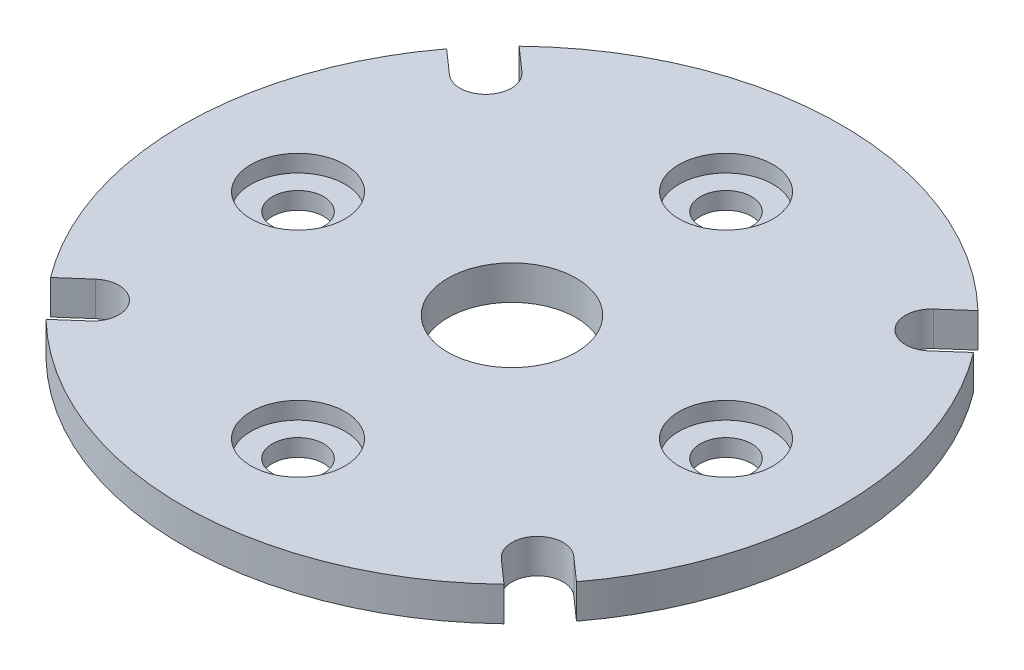
ISO-10303-21;
HEADER;
FILE_DESCRIPTION(('STEP AP214'),'2;1');
FILE_NAME('part.step','',(''),(''),'','','');
FILE_SCHEMA(('AUTOMOTIVE_DESIGN { 1 0 10303 214 1 1 1 1 }'));
ENDSEC;
DATA;
#1=APPLICATION_CONTEXT('core data for automotive mechanical design processes');
#2=APPLICATION_PROTOCOL_DEFINITION('international standard','automotive_design',2000,#1);
#3=PRODUCT_CONTEXT('',#1,'mechanical');
#4=PRODUCT('Part','Part','',(#3));
#5=PRODUCT_RELATED_PRODUCT_CATEGORY('part','',(#4));
#6=PRODUCT_DEFINITION_FORMATION('','',#4);
#7=PRODUCT_DEFINITION_CONTEXT('part definition',#1,'design');
#8=PRODUCT_DEFINITION('design','',#6,#7);
#9=PRODUCT_DEFINITION_SHAPE('','',#8);
#10=(LENGTH_UNIT() NAMED_UNIT(*) SI_UNIT(.MILLI.,.METRE.));
#11=(NAMED_UNIT(*) PLANE_ANGLE_UNIT() SI_UNIT($,.RADIAN.));
#12=(NAMED_UNIT(*) SI_UNIT($,.STERADIAN.) SOLID_ANGLE_UNIT());
#13=UNCERTAINTY_MEASURE_WITH_UNIT(LENGTH_MEASURE(1.E-05),#10,'distance_accuracy_value','');
#14=(GEOMETRIC_REPRESENTATION_CONTEXT(3) GLOBAL_UNCERTAINTY_ASSIGNED_CONTEXT((#13)) GLOBAL_UNIT_ASSIGNED_CONTEXT((#10,
#11,#12)) REPRESENTATION_CONTEXT('',''));
#15=CARTESIAN_POINT('',(0.,0.,0.));
#16=DIRECTION('',(0.,0.,1.));
#17=DIRECTION('',(1.,0.,0.));
#18=AXIS2_PLACEMENT_3D('',#15,#16,#17);
#19=CARTESIAN_POINT('',(-2196.04150385978,-137.284072907056,1150.50690940021));
#20=DIRECTION('',(0.,-1.,-1.36470032429931E-12));
#21=DIRECTION('',(1.,0.,0.));
#22=AXIS2_PLACEMENT_3D('',#19,#20,#21);
#23=PLANE('',#22);
#24=CARTESIAN_POINT('',(-2221.04150385978,-137.284072907056,1150.50690940021));
#25=DIRECTION('',(0.,-1.,-1.36470032429931E-12));
#26=DIRECTION('',(1.,0.,0.));
#27=AXIS2_PLACEMENT_3D('',#24,#25,#26);
#28=CIRCLE('',#27,3.00000000000011);
#29=CARTESIAN_POINT('',(-2218.04150385978,-137.284072907056,1150.50690940021));
#30=VERTEX_POINT('',#29);
#31=EDGE_CURVE('E213',#30,#30,#28,.T.);
#32=ORIENTED_EDGE('',*,*,#31,.T.);
#33=EDGE_LOOP('',(#32));
#34=FACE_BOUND('',#33,.T.);
#35=CARTESIAN_POINT('',(-2221.04150385978,-137.284072907056,1150.50690940021));
#36=DIRECTION('',(0.,-1.,-1.36470032429931E-12));
#37=DIRECTION('',(1.,0.,0.));
#38=AXIS2_PLACEMENT_3D('',#35,#36,#37);
#39=CIRCLE('',#38,5.50000000000006);
#40=CARTESIAN_POINT('',(-2215.54150385978,-137.284072907056,1150.50690940021));
#41=VERTEX_POINT('',#40);
#42=EDGE_CURVE('E170',#41,#41,#39,.T.);
#43=ORIENTED_EDGE('',*,*,#42,.F.);
#44=EDGE_LOOP('',(#43));
#45=FACE_BOUND('',#44,.T.);
#46=ADVANCED_FACE('F34',(#34,#45),#23,.F.);
#47=CARTESIAN_POINT('',(-2196.04150385978,-137.28407290709,1175.50690940021));
#48=DIRECTION('',(0.,-1.,-1.36470032429931E-12));
#49=DIRECTION('',(1.,0.,0.));
#50=AXIS2_PLACEMENT_3D('',#47,#48,#49);
#51=CIRCLE('',#50,3.00000000000011);
#52=CARTESIAN_POINT('',(-2193.04150385978,-137.28407290709,1175.50690940021));
#53=VERTEX_POINT('',#52);
#54=EDGE_CURVE('E229',#53,#53,#51,.T.);
#55=ORIENTED_EDGE('',*,*,#54,.T.);
#56=EDGE_LOOP('',(#55));
#57=FACE_BOUND('',#56,.T.);
#58=CARTESIAN_POINT('',(-2196.04150385978,-137.28407290709,1175.50690940021));
#59=DIRECTION('',(0.,-1.,-1.36470032429931E-12));
#60=DIRECTION('',(1.,0.,0.));
#61=AXIS2_PLACEMENT_3D('',#58,#59,#60);
#62=CIRCLE('',#61,5.50000000000006);
#63=CARTESIAN_POINT('',(-2190.54150385978,-137.28407290709,1175.50690940021));
#64=VERTEX_POINT('',#63);
#65=EDGE_CURVE('E409',#64,#64,#62,.T.);
#66=ORIENTED_EDGE('',*,*,#65,.F.);
#67=EDGE_LOOP('',(#66));
#68=FACE_BOUND('',#67,.T.);
#69=ADVANCED_FACE('F373',(#57,#68),#23,.F.);
#70=CARTESIAN_POINT('',(-2196.04150385978,-137.284072907022,1125.50690940021));
#71=DIRECTION('',(0.,-1.,-1.36470032429931E-12));
#72=DIRECTION('',(1.,0.,0.));
#73=AXIS2_PLACEMENT_3D('',#70,#71,#72);
#74=CIRCLE('',#73,3.00000000000011);
#75=CARTESIAN_POINT('',(-2193.04150385978,-137.284072907022,1125.50690940021));
#76=VERTEX_POINT('',#75);
#77=EDGE_CURVE('E217',#76,#76,#74,.T.);
#78=ORIENTED_EDGE('',*,*,#77,.T.);
#79=EDGE_LOOP('',(#78));
#80=FACE_BOUND('',#79,.T.);
#81=CARTESIAN_POINT('',(-2196.04150385978,-137.284072907022,1125.50690940021));
#82=DIRECTION('',(0.,-1.,-1.36470032429931E-12));
#83=DIRECTION('',(1.,0.,0.));
#84=AXIS2_PLACEMENT_3D('',#81,#82,#83);
#85=CIRCLE('',#84,5.50000000000006);
#86=CARTESIAN_POINT('',(-2190.54150385978,-137.284072907022,1125.50690940021));
#87=VERTEX_POINT('',#86);
#88=EDGE_CURVE('E401',#87,#87,#85,.T.);
#89=ORIENTED_EDGE('',*,*,#88,.F.);
#90=EDGE_LOOP('',(#89));
#91=FACE_BOUND('',#90,.T.);
#92=ADVANCED_FACE('F379',(#80,#91),#23,.F.);
#93=CARTESIAN_POINT('',(-2171.04150385978,-137.284072907056,1150.50690940021));
#94=DIRECTION('',(0.,-1.,-1.36470032429931E-12));
#95=DIRECTION('',(1.,0.,0.));
#96=AXIS2_PLACEMENT_3D('',#93,#94,#95);
#97=CIRCLE('',#96,3.00000000000011);
#98=CARTESIAN_POINT('',(-2168.04150385978,-137.284072907056,1150.50690940021));
#99=VERTEX_POINT('',#98);
#100=EDGE_CURVE('E223',#99,#99,#97,.T.);
#101=ORIENTED_EDGE('',*,*,#100,.T.);
#102=EDGE_LOOP('',(#101));
#103=FACE_BOUND('',#102,.T.);
#104=CARTESIAN_POINT('',(-2171.04150385978,-137.284072907056,1150.50690940021));
#105=DIRECTION('',(0.,-1.,-1.36470032429931E-12));
#106=DIRECTION('',(1.,0.,0.));
#107=AXIS2_PLACEMENT_3D('',#104,#105,#106);
#108=CIRCLE('',#107,5.50000000000006);
#109=CARTESIAN_POINT('',(-2165.54150385978,-137.284072907056,1150.50690940021));
#110=VERTEX_POINT('',#109);
#111=EDGE_CURVE('E395',#110,#110,#108,.T.);
#112=ORIENTED_EDGE('',*,*,#111,.F.);
#113=EDGE_LOOP('',(#112));
#114=FACE_BOUND('',#113,.T.);
#115=ADVANCED_FACE('F375',(#103,#114),#23,.F.);
#116=CARTESIAN_POINT('',(-2196.04150385978,-139.284072907056,1150.50690940021));
#117=DIRECTION('',(0.,-1.,-1.36470032429931E-12));
#118=DIRECTION('',(1.,0.,0.));
#119=AXIS2_PLACEMENT_3D('',#116,#117,#118);
#120=PLANE('',#119);
#121=CARTESIAN_POINT('',(-2196.04150385978,-139.284072907022,1125.50690940021));
#122=DIRECTION('',(0.,-1.,-1.36470032429931E-12));
#123=DIRECTION('',(1.,0.,0.));
#124=AXIS2_PLACEMENT_3D('',#121,#122,#123);
#125=CIRCLE('',#124,3.00000000000011);
#126=CARTESIAN_POINT('',(-2193.04150385978,-139.284072907022,1125.50690940021));
#127=VERTEX_POINT('',#126);
#128=EDGE_CURVE('E220',#127,#127,#125,.T.);
#129=ORIENTED_EDGE('',*,*,#128,.F.);
#130=EDGE_LOOP('',(#129));
#131=FACE_BOUND('',#130,.T.);
#132=CARTESIAN_POINT('',(-2196.04150385978,-139.28407290709,1175.50690940021));
#133=DIRECTION('',(0.,-1.,-1.36470032429931E-12));
#134=DIRECTION('',(1.,0.,0.));
#135=AXIS2_PLACEMENT_3D('',#132,#133,#134);
#136=CIRCLE('',#135,3.00000000000011);
#137=CARTESIAN_POINT('',(-2193.04150385978,-139.28407290709,1175.50690940021));
#138=VERTEX_POINT('',#137);
#139=EDGE_CURVE('E232',#138,#138,#136,.T.);
#140=ORIENTED_EDGE('',*,*,#139,.F.);
#141=EDGE_LOOP('',(#140));
#142=FACE_BOUND('',#141,.T.);
#143=CARTESIAN_POINT('',(-2196.04150385978,-139.284072907056,1150.50690940021));
#144=DIRECTION('',(0.,-1.,-1.36470032429931E-12));
#145=DIRECTION('',(1.,0.,0.));
#146=AXIS2_PLACEMENT_3D('',#143,#144,#145);
#147=CIRCLE('',#146,38.5000000000003);
#148=CARTESIAN_POINT('',(-2222.84674281354,-139.284072907018,1122.87125915218));
#149=VERTEX_POINT('',#148);
#150=CARTESIAN_POINT('',(-2169.29070567137,-139.284072907018,1122.81855812601));
#151=VERTEX_POINT('',#150);
#152=EDGE_CURVE('E240',#149,#151,#147,.T.);
#153=ORIENTED_EDGE('',*,*,#152,.T.);
#154=DIRECTION('',(-0.748753116344691,-9.04646381676967E-13,0.662848980359866));
#155=VECTOR('',#154,1.);
#156=CARTESIAN_POINT('',(-2169.29070567137,-139.284072907018,1122.81855812601));
#157=LINE('',#156,#155);
#158=CARTESIAN_POINT('',(-2172.04928868732,-139.284072907021,1125.26065005117));
#159=VERTEX_POINT('',#158);
#160=EDGE_CURVE('E151',#151,#159,#157,.T.);
#161=ORIENTED_EDGE('',*,*,#160,.T.);
#162=CARTESIAN_POINT('',(-2170.06074174624,-139.284072907024,1127.50690940021));
#163=DIRECTION('',(0.,1.,1.36470032429931E-12));
#164=DIRECTION('',(1.,0.,0.));
#165=AXIS2_PLACEMENT_3D('',#162,#163,#164);
#166=CIRCLE('',#165,3.00000000000012);
#167=CARTESIAN_POINT('',(-2168.07219480516,-139.284072907027,1129.75316874924));
#168=VERTEX_POINT('',#167);
#169=EDGE_CURVE('E243',#159,#168,#166,.T.);
#170=ORIENTED_EDGE('',*,*,#169,.T.);
#171=DIRECTION('',(0.748753116344695,9.04646381676961E-13,-0.662848980359861));
#172=VECTOR('',#171,1.);
#173=CARTESIAN_POINT('',(-2165.31361178921,-139.284072907024,1127.31107682408));
#174=LINE('',#173,#172);
#175=CARTESIAN_POINT('',(-2165.31361178921,-139.284072907024,1127.31107682408));
#176=VERTEX_POINT('',#175);
#177=EDGE_CURVE('E245',#168,#176,#174,.T.);
#178=ORIENTED_EDGE('',*,*,#177,.T.);
#179=CARTESIAN_POINT('',(-2196.04150385978,-139.284072907056,1150.50690940021));
#180=DIRECTION('',(0.,-1.,-1.36470032429931E-12));
#181=DIRECTION('',(1.,0.,0.));
#182=AXIS2_PLACEMENT_3D('',#179,#180,#181);
#183=CIRCLE('',#182,38.5000000000002);
#184=CARTESIAN_POINT('',(-2165.31361178921,-139.284072907087,1173.70274197633));
#185=VERTEX_POINT('',#184);
#186=EDGE_CURVE('E247',#176,#185,#183,.T.);
#187=ORIENTED_EDGE('',*,*,#186,.T.);
#188=DIRECTION('',(-0.748753116344742,9.04534055240105E-13,-0.662848980359808));
#189=VECTOR('',#188,1.);
#190=CARTESIAN_POINT('',(-2165.31361178921,-139.284072907087,1173.70274197633));
#191=LINE('',#190,#189);
#192=CARTESIAN_POINT('',(-2168.07219480516,-139.284072907084,1171.26065005117));
#193=VERTEX_POINT('',#192);
#194=EDGE_CURVE('E249',#185,#193,#191,.T.);
#195=ORIENTED_EDGE('',*,*,#194,.T.);
#196=CARTESIAN_POINT('',(-2170.06074174624,-139.284072907087,1173.50690940021));
#197=DIRECTION('',(0.,1.,1.36470032429931E-12));
#198=DIRECTION('',(1.,0.,0.));
#199=AXIS2_PLACEMENT_3D('',#196,#197,#198);
#200=CIRCLE('',#199,3.00000000000015);
#201=CARTESIAN_POINT('',(-2172.04928868732,-139.28407290709,1175.75316874924));
#202=VERTEX_POINT('',#201);
#203=EDGE_CURVE('E251',#193,#202,#200,.T.);
#204=ORIENTED_EDGE('',*,*,#203,.T.);
#205=DIRECTION('',(0.748753116344746,-9.045340552401E-13,0.662848980359804));
#206=VECTOR('',#205,1.);
#207=CARTESIAN_POINT('',(-2169.29070567137,-139.284072907093,1178.1952606744));
#208=LINE('',#207,#206);
#209=CARTESIAN_POINT('',(-2169.29070567137,-139.284072907093,1178.1952606744));
#210=VERTEX_POINT('',#209);
#211=EDGE_CURVE('E253',#202,#210,#208,.T.);
#212=ORIENTED_EDGE('',*,*,#211,.T.);
#213=CARTESIAN_POINT('',(-2196.04150385978,-139.284072907056,1150.50690940021));
#214=DIRECTION('',(0.,-1.,-1.36470032429931E-12));
#215=DIRECTION('',(1.,0.,0.));
#216=AXIS2_PLACEMENT_3D('',#213,#214,#215);
#217=CIRCLE('',#216,38.5000000000003);
#218=CARTESIAN_POINT('',(-2222.84674281354,-139.284072907093,1178.14255964824));
#219=VERTEX_POINT('',#218);
#220=EDGE_CURVE('E255',#210,#219,#217,.T.);
#221=ORIENTED_EDGE('',*,*,#220,.T.);
#222=DIRECTION('',(0.750056198478623,9.0263370865485E-13,-0.661374099223576));
#223=VECTOR('',#222,1.);
#224=CARTESIAN_POINT('',(-2222.84674281354,-139.284072907093,1178.14255964824));
#225=LINE('',#224,#223);
#226=CARTESIAN_POINT('',(-2220.06395133656,-139.28407290709,1175.68878857061));
#227=VERTEX_POINT('',#226);
#228=EDGE_CURVE('E257',#219,#227,#225,.T.);
#229=ORIENTED_EDGE('',*,*,#228,.T.);
#230=CARTESIAN_POINT('',(-2222.04807363423,-139.284072907087,1173.43861997518));
#231=DIRECTION('',(0.,1.,1.36470032429931E-12));
#232=DIRECTION('',(1.,0.,0.));
#233=AXIS2_PLACEMENT_3D('',#230,#231,#232);
#234=CIRCLE('',#233,3.00000000000024);
#235=CARTESIAN_POINT('',(-2224.0321959319,-139.284072907084,1171.18845137974));
#236=VERTEX_POINT('',#235);
#237=EDGE_CURVE('E259',#227,#236,#234,.T.);
#238=ORIENTED_EDGE('',*,*,#237,.T.);
#239=DIRECTION('',(-0.750056198478589,-9.02633708654903E-13,0.661374099223615));
#240=VECTOR('',#239,1.);
#241=CARTESIAN_POINT('',(-2226.81498740889,-139.284072907087,1173.64222245736));
#242=LINE('',#241,#240);
#243=CARTESIAN_POINT('',(-2226.81498740889,-139.284072907087,1173.64222245736));
#244=VERTEX_POINT('',#243);
#245=EDGE_CURVE('E261',#236,#244,#242,.T.);
#246=ORIENTED_EDGE('',*,*,#245,.T.);
#247=CARTESIAN_POINT('',(-2196.04150385978,-139.284072907056,1150.50690940021));
#248=DIRECTION('',(0.,-1.,-1.36470032429931E-12));
#249=DIRECTION('',(1.,0.,0.));
#250=AXIS2_PLACEMENT_3D('',#247,#248,#249);
#251=CIRCLE('',#250,38.5000000000003);
#252=CARTESIAN_POINT('',(-2226.81498740889,-139.284072907024,1127.37159634305));
#253=VERTEX_POINT('',#252);
#254=EDGE_CURVE('E263',#244,#253,#251,.T.);
#255=ORIENTED_EDGE('',*,*,#254,.T.);
#256=DIRECTION('',(0.750056198478618,-9.02521186732314E-13,0.661374099223582));
#257=VECTOR('',#256,1.);
#258=CARTESIAN_POINT('',(-2226.81498740889,-139.284072907024,1127.37159634305));
#259=LINE('',#258,#257);
#260=CARTESIAN_POINT('',(-2224.0321959319,-139.284072907027,1129.82536742067));
#261=VERTEX_POINT('',#260);
#262=EDGE_CURVE('E265',#253,#261,#259,.T.);
#263=ORIENTED_EDGE('',*,*,#262,.T.);
#264=CARTESIAN_POINT('',(-2222.04807363423,-139.284072907024,1127.57519882524));
#265=DIRECTION('',(0.,1.,1.36470032429931E-12));
#266=DIRECTION('',(1.,0.,0.));
#267=AXIS2_PLACEMENT_3D('',#264,#265,#266);
#268=CIRCLE('',#267,3.00000000000018);
#269=CARTESIAN_POINT('',(-2220.06395133656,-139.284072907021,1125.3250302298));
#270=VERTEX_POINT('',#269);
#271=EDGE_CURVE('E54',#261,#270,#268,.T.);
#272=ORIENTED_EDGE('',*,*,#271,.T.);
#273=DIRECTION('',(-0.750056198478626,9.02521186732301E-13,-0.661374099223573));
#274=VECTOR('',#273,1.);
#275=CARTESIAN_POINT('',(-2222.84674281354,-139.284072907018,1122.87125915218));
#276=LINE('',#275,#274);
#277=EDGE_CURVE('E49',#270,#149,#276,.T.);
#278=ORIENTED_EDGE('',*,*,#277,.T.);
#279=EDGE_LOOP('',(#153,#161,#170,#178,#187,#195,#204,#212,#221,#229,#238,#246,#255,#263,#272,#278));
#280=FACE_BOUND('',#279,.T.);
#281=CARTESIAN_POINT('',(-2196.04150385978,-139.284072907056,1150.50690940021));
#282=DIRECTION('',(0.,-1.,-1.36470032429931E-12));
#283=DIRECTION('',(1.,0.,0.));
#284=AXIS2_PLACEMENT_3D('',#281,#282,#283);
#285=CIRCLE('',#284,7.49999999999984);
#286=CARTESIAN_POINT('',(-2188.54150385978,-139.284072907056,1150.50690940021));
#287=VERTEX_POINT('',#286);
#288=EDGE_CURVE('E235',#287,#287,#285,.T.);
#289=ORIENTED_EDGE('',*,*,#288,.F.);
#290=EDGE_LOOP('',(#289));
#291=FACE_BOUND('',#290,.T.);
#292=CARTESIAN_POINT('',(-2171.04150385978,-139.284072907056,1150.50690940021));
#293=DIRECTION('',(0.,-1.,-1.36470032429931E-12));
#294=DIRECTION('',(1.,0.,0.));
#295=AXIS2_PLACEMENT_3D('',#292,#293,#294);
#296=CIRCLE('',#295,3.00000000000011);
#297=CARTESIAN_POINT('',(-2168.04150385978,-139.284072907056,1150.50690940021));
#298=VERTEX_POINT('',#297);
#299=EDGE_CURVE('E226',#298,#298,#296,.T.);
#300=ORIENTED_EDGE('',*,*,#299,.F.);
#301=EDGE_LOOP('',(#300));
#302=FACE_BOUND('',#301,.T.);
#303=CARTESIAN_POINT('',(-2221.04150385978,-139.284072907056,1150.50690940021));
#304=DIRECTION('',(0.,-1.,-1.36470032429931E-12));
#305=DIRECTION('',(1.,0.,0.));
#306=AXIS2_PLACEMENT_3D('',#303,#304,#305);
#307=CIRCLE('',#306,3.00000000000011);
#308=CARTESIAN_POINT('',(-2218.04150385978,-139.284072907056,1150.50690940021));
#309=VERTEX_POINT('',#308);
#310=EDGE_CURVE('E214',#309,#309,#307,.T.);
#311=ORIENTED_EDGE('',*,*,#310,.F.);
#312=EDGE_LOOP('',(#311));
#313=FACE_BOUND('',#312,.T.);
#314=ADVANCED_FACE('F300',(#131,#142,#280,#291,#302,#313),#120,.T.);
#315=CARTESIAN_POINT('',(-2196.04150385978,-139.284072907056,1150.50690940021));
#316=DIRECTION('',(0.,1.,1.36470032429931E-12));
#317=DIRECTION('',(-1.,0.,0.));
#318=AXIS2_PLACEMENT_3D('',#315,#316,#317);
#319=CYLINDRICAL_SURFACE('',#318,38.5000000000003);
#320=DIRECTION('',(0.,1.,1.36470032429931E-12));
#321=VECTOR('',#320,1.);
#322=CARTESIAN_POINT('',(-2222.84674281354,-139.284072907018,1122.87125915218));
#323=LINE('',#322,#321);
#324=CARTESIAN_POINT('',(-2222.84674281354,-135.284072907018,1122.87125915218));
#325=VERTEX_POINT('',#324);
#326=EDGE_CURVE('E165',#149,#325,#323,.T.);
#327=ORIENTED_EDGE('',*,*,#326,.T.);
#328=CARTESIAN_POINT('',(-2196.04150385978,-135.284072907056,1150.50690940021));
#329=DIRECTION('',(0.,-1.,-1.36470032429931E-12));
#330=DIRECTION('',(1.,0.,0.));
#331=AXIS2_PLACEMENT_3D('',#328,#329,#330);
#332=CIRCLE('',#331,38.5000000000004);
#333=CARTESIAN_POINT('',(-2169.29070567137,-135.284072907018,1122.81855812602));
#334=VERTEX_POINT('',#333);
#335=EDGE_CURVE('E160',#325,#334,#332,.T.);
#336=ORIENTED_EDGE('',*,*,#335,.T.);
#337=DIRECTION('',(0.,1.,1.36470032429931E-12));
#338=VECTOR('',#337,1.);
#339=CARTESIAN_POINT('',(-2169.29070567137,-139.284072907018,1122.81855812601));
#340=LINE('',#339,#338);
#341=EDGE_CURVE('E11',#151,#334,#340,.T.);
#342=ORIENTED_EDGE('',*,*,#341,.F.);
#343=ORIENTED_EDGE('',*,*,#152,.F.);
#344=EDGE_LOOP('',(#327,#336,#342,#343));
#345=FACE_BOUND('',#344,.T.);
#346=ADVANCED_FACE('F36',(#345),#319,.T.);
#347=CARTESIAN_POINT('',(-2169.29070567137,-139.284072907018,1122.81855812601));
#348=DIRECTION('',(-0.662848980359866,1.02177390106019E-12,-0.748753116344691));
#349=DIRECTION('',(0.748753116344691,9.04646381676967E-13,-0.662848980359866));
#350=AXIS2_PLACEMENT_3D('',#347,#348,#349);
#351=PLANE('',#350);
#352=ORIENTED_EDGE('',*,*,#341,.T.);
#353=DIRECTION('',(-0.748753116344686,-9.04646381676975E-13,0.662848980359871));
#354=VECTOR('',#353,1.);
#355=CARTESIAN_POINT('',(-2169.29070567137,-135.284072907018,1122.81855812602));
#356=LINE('',#355,#354);
#357=CARTESIAN_POINT('',(-2172.04928868732,-135.284072907021,1125.26065005118));
#358=VERTEX_POINT('',#357);
#359=EDGE_CURVE('E149',#334,#358,#356,.T.);
#360=ORIENTED_EDGE('',*,*,#359,.T.);
#361=DIRECTION('',(0.,1.,1.36470032429931E-12));
#362=VECTOR('',#361,1.);
#363=CARTESIAN_POINT('',(-2172.04928868732,-139.284072907021,1125.26065005117));
#364=LINE('',#363,#362);
#365=EDGE_CURVE('E42',#159,#358,#364,.T.);
#366=ORIENTED_EDGE('',*,*,#365,.F.);
#367=ORIENTED_EDGE('',*,*,#160,.F.);
#368=EDGE_LOOP('',(#352,#360,#366,#367));
#369=FACE_BOUND('',#368,.T.);
#370=ADVANCED_FACE('F147',(#369),#351,.F.);
#371=CARTESIAN_POINT('',(-2170.06074174624,-139.284072907024,1127.50690940021));
#372=DIRECTION('',(0.,1.,1.36470032429931E-12));
#373=DIRECTION('',(-1.,0.,0.));
#374=AXIS2_PLACEMENT_3D('',#371,#372,#373);
#375=CYLINDRICAL_SURFACE('',#374,3.00000000000012);
#376=ORIENTED_EDGE('',*,*,#365,.T.);
#377=CARTESIAN_POINT('',(-2170.06074174624,-135.284072907024,1127.50690940021));
#378=DIRECTION('',(0.,1.,1.36470032429931E-12));
#379=DIRECTION('',(1.,0.,0.));
#380=AXIS2_PLACEMENT_3D('',#377,#378,#379);
#381=CIRCLE('',#380,3.00000000000024);
#382=CARTESIAN_POINT('',(-2168.07219480516,-135.284072907027,1129.75316874925));
#383=VERTEX_POINT('',#382);
#384=EDGE_CURVE('E163',#358,#383,#381,.T.);
#385=ORIENTED_EDGE('',*,*,#384,.T.);
#386=DIRECTION('',(0.,1.,1.36470032429931E-12));
#387=VECTOR('',#386,1.);
#388=CARTESIAN_POINT('',(-2168.07219480516,-139.284072907027,1129.75316874924));
#389=LINE('',#388,#387);
#390=EDGE_CURVE('E294',#168,#383,#389,.T.);
#391=ORIENTED_EDGE('',*,*,#390,.F.);
#392=ORIENTED_EDGE('',*,*,#169,.F.);
#393=EDGE_LOOP('',(#376,#385,#391,#392));
#394=FACE_BOUND('',#393,.T.);
#395=ADVANCED_FACE('F297',(#394),#375,.F.);
#396=CARTESIAN_POINT('',(-2165.31361178921,-139.284072907024,1127.31107682408));
#397=DIRECTION('',(0.662848980359861,-1.0217739010602E-12,0.748753116344695));
#398=DIRECTION('',(-0.748753116344695,-9.04646381676961E-13,0.662848980359861));
#399=AXIS2_PLACEMENT_3D('',#396,#397,#398);
#400=PLANE('',#399);
#401=ORIENTED_EDGE('',*,*,#390,.T.);
#402=DIRECTION('',(0.748753116344689,9.04646381676971E-13,-0.662848980359868));
#403=VECTOR('',#402,1.);
#404=CARTESIAN_POINT('',(-2165.31361178921,-135.284072907024,1127.31107682409));
#405=LINE('',#404,#403);
#406=CARTESIAN_POINT('',(-2165.31361178921,-135.284072907024,1127.31107682409));
#407=VERTEX_POINT('',#406);
#408=EDGE_CURVE('E175',#383,#407,#405,.T.);
#409=ORIENTED_EDGE('',*,*,#408,.T.);
#410=DIRECTION('',(0.,1.,1.36470032429931E-12));
#411=VECTOR('',#410,1.);
#412=CARTESIAN_POINT('',(-2165.31361178921,-139.284072907024,1127.31107682408));
#413=LINE('',#412,#411);
#414=EDGE_CURVE('E292',#176,#407,#413,.T.);
#415=ORIENTED_EDGE('',*,*,#414,.F.);
#416=ORIENTED_EDGE('',*,*,#177,.F.);
#417=EDGE_LOOP('',(#401,#409,#415,#416));
#418=FACE_BOUND('',#417,.T.);
#419=ADVANCED_FACE('F306',(#418),#400,.F.);
#420=CARTESIAN_POINT('',(-2196.04150385978,-139.284072907056,1150.50690940021));
#421=DIRECTION('',(0.,1.,1.36470032429931E-12));
#422=DIRECTION('',(-1.,0.,0.));
#423=AXIS2_PLACEMENT_3D('',#420,#421,#422);
#424=CYLINDRICAL_SURFACE('',#423,38.5000000000002);
#425=ORIENTED_EDGE('',*,*,#414,.T.);
#426=CARTESIAN_POINT('',(-2196.04150385978,-135.284072907056,1150.50690940021));
#427=DIRECTION('',(0.,-1.,-1.36470032429931E-12));
#428=DIRECTION('',(1.,0.,0.));
#429=AXIS2_PLACEMENT_3D('',#426,#427,#428);
#430=CIRCLE('',#429,38.5000000000004);
#431=CARTESIAN_POINT('',(-2165.31361178921,-135.284072907087,1173.70274197634));
#432=VERTEX_POINT('',#431);
#433=EDGE_CURVE('E178',#407,#432,#430,.T.);
#434=ORIENTED_EDGE('',*,*,#433,.T.);
#435=DIRECTION('',(0.,1.,1.36470032429931E-12));
#436=VECTOR('',#435,1.);
#437=CARTESIAN_POINT('',(-2165.31361178921,-139.284072907087,1173.70274197633));
#438=LINE('',#437,#436);
#439=EDGE_CURVE('E290',#185,#432,#438,.T.);
#440=ORIENTED_EDGE('',*,*,#439,.F.);
#441=ORIENTED_EDGE('',*,*,#186,.F.);
#442=EDGE_LOOP('',(#425,#434,#440,#441));
#443=FACE_BOUND('',#442,.T.);
#444=ADVANCED_FACE('F309',(#443),#424,.T.);
#445=CARTESIAN_POINT('',(-2165.31361178921,-139.284072907087,1173.70274197633));
#446=DIRECTION('',(0.662848980359808,1.02187334033132E-12,-0.748753116344742));
#447=DIRECTION('',(0.748753116344742,-9.04534055240105E-13,0.662848980359808));
#448=AXIS2_PLACEMENT_3D('',#445,#446,#447);
#449=PLANE('',#448);
#450=ORIENTED_EDGE('',*,*,#439,.T.);
#451=DIRECTION('',(-0.748753116344692,9.04534055240183E-13,-0.662848980359865));
#452=VECTOR('',#451,1.);
#453=CARTESIAN_POINT('',(-2165.31361178921,-135.284072907087,1173.70274197634));
#454=LINE('',#453,#452);
#455=CARTESIAN_POINT('',(-2168.07219480516,-135.284072907084,1171.26065005118));
#456=VERTEX_POINT('',#455);
#457=EDGE_CURVE('E181',#432,#456,#454,.T.);
#458=ORIENTED_EDGE('',*,*,#457,.T.);
#459=DIRECTION('',(0.,1.,1.36470032429931E-12));
#460=VECTOR('',#459,1.);
#461=CARTESIAN_POINT('',(-2168.07219480516,-139.284072907084,1171.26065005117));
#462=LINE('',#461,#460);
#463=EDGE_CURVE('E288',#193,#456,#462,.T.);
#464=ORIENTED_EDGE('',*,*,#463,.F.);
#465=ORIENTED_EDGE('',*,*,#194,.F.);
#466=EDGE_LOOP('',(#450,#458,#464,#465));
#467=FACE_BOUND('',#466,.T.);
#468=ADVANCED_FACE('F314',(#467),#449,.F.);
#469=CARTESIAN_POINT('',(-2170.06074174624,-139.284072907087,1173.50690940021));
#470=DIRECTION('',(0.,1.,1.36470032429931E-12));
#471=DIRECTION('',(-1.,0.,0.));
#472=AXIS2_PLACEMENT_3D('',#469,#470,#471);
#473=CYLINDRICAL_SURFACE('',#472,3.00000000000015);
#474=ORIENTED_EDGE('',*,*,#463,.T.);
#475=CARTESIAN_POINT('',(-2170.06074174624,-135.284072907087,1173.50690940021));
#476=DIRECTION('',(0.,1.,1.36470032429931E-12));
#477=DIRECTION('',(1.,0.,0.));
#478=AXIS2_PLACEMENT_3D('',#475,#476,#477);
#479=CIRCLE('',#478,3.00000000000033);
#480=CARTESIAN_POINT('',(-2172.04928868732,-135.28407290709,1175.75316874925));
#481=VERTEX_POINT('',#480);
#482=EDGE_CURVE('E184',#456,#481,#479,.T.);
#483=ORIENTED_EDGE('',*,*,#482,.T.);
#484=DIRECTION('',(0.,1.,1.36470032429931E-12));
#485=VECTOR('',#484,1.);
#486=CARTESIAN_POINT('',(-2172.04928868732,-139.28407290709,1175.75316874924));
#487=LINE('',#486,#485);
#488=EDGE_CURVE('E286',#202,#481,#487,.T.);
#489=ORIENTED_EDGE('',*,*,#488,.F.);
#490=ORIENTED_EDGE('',*,*,#203,.F.);
#491=EDGE_LOOP('',(#474,#483,#489,#490));
#492=FACE_BOUND('',#491,.T.);
#493=ADVANCED_FACE('F320',(#492),#473,.F.);
#494=CARTESIAN_POINT('',(-2169.29070567137,-139.284072907093,1178.1952606744));
#495=DIRECTION('',(-0.662848980359804,-1.02187334033132E-12,0.748753116344746));
#496=DIRECTION('',(-0.748753116344746,9.045340552401E-13,-0.662848980359804));
#497=AXIS2_PLACEMENT_3D('',#494,#495,#496);
#498=PLANE('',#497);
#499=ORIENTED_EDGE('',*,*,#488,.T.);
#500=DIRECTION('',(0.748753116344746,-9.045340552401E-13,0.662848980359804));
#501=VECTOR('',#500,1.);
#502=CARTESIAN_POINT('',(-2169.29070567137,-135.284072907093,1178.19526067441));
#503=LINE('',#502,#501);
#504=CARTESIAN_POINT('',(-2169.29070567137,-135.284072907093,1178.19526067441));
#505=VERTEX_POINT('',#504);
#506=EDGE_CURVE('E187',#481,#505,#503,.T.);
#507=ORIENTED_EDGE('',*,*,#506,.T.);
#508=DIRECTION('',(0.,1.,1.36470032429931E-12));
#509=VECTOR('',#508,1.);
#510=CARTESIAN_POINT('',(-2169.29070567137,-139.284072907093,1178.1952606744));
#511=LINE('',#510,#509);
#512=EDGE_CURVE('E284',#210,#505,#511,.T.);
#513=ORIENTED_EDGE('',*,*,#512,.F.);
#514=ORIENTED_EDGE('',*,*,#211,.F.);
#515=EDGE_LOOP('',(#499,#507,#513,#514));
#516=FACE_BOUND('',#515,.T.);
#517=ADVANCED_FACE('F324',(#516),#498,.F.);
#518=CARTESIAN_POINT('',(-2196.04150385978,-139.284072907056,1150.50690940021));
#519=DIRECTION('',(0.,1.,1.36470032429931E-12));
#520=DIRECTION('',(-1.,0.,0.));
#521=AXIS2_PLACEMENT_3D('',#518,#519,#520);
#522=CYLINDRICAL_SURFACE('',#521,38.5000000000003);
#523=ORIENTED_EDGE('',*,*,#512,.T.);
#524=CARTESIAN_POINT('',(-2196.04150385978,-135.284072907056,1150.50690940021));
#525=DIRECTION('',(0.,-1.,-1.36470032429931E-12));
#526=DIRECTION('',(1.,0.,0.));
#527=AXIS2_PLACEMENT_3D('',#524,#525,#526);
#528=CIRCLE('',#527,38.5000000000001);
#529=CARTESIAN_POINT('',(-2222.84674281354,-135.284072907093,1178.14255964824));
#530=VERTEX_POINT('',#529);
#531=EDGE_CURVE('E190',#505,#530,#528,.T.);
#532=ORIENTED_EDGE('',*,*,#531,.T.);
#533=DIRECTION('',(0.,1.,1.36470032429931E-12));
#534=VECTOR('',#533,1.);
#535=CARTESIAN_POINT('',(-2222.84674281354,-139.284072907093,1178.14255964824));
#536=LINE('',#535,#534);
#537=EDGE_CURVE('E282',#219,#530,#536,.T.);
#538=ORIENTED_EDGE('',*,*,#537,.F.);
#539=ORIENTED_EDGE('',*,*,#220,.F.);
#540=EDGE_LOOP('',(#523,#532,#538,#539));
#541=FACE_BOUND('',#540,.T.);
#542=ADVANCED_FACE('F329',(#541),#522,.T.);
#543=CARTESIAN_POINT('',(-2222.84674281354,-139.284072907093,1178.14255964824));
#544=DIRECTION('',(0.661374099223576,-1.02355232830031E-12,0.750056198478623));
#545=DIRECTION('',(-0.750056198478623,-9.0263370865485E-13,0.661374099223576));
#546=AXIS2_PLACEMENT_3D('',#543,#544,#545);
#547=PLANE('',#546);
#548=ORIENTED_EDGE('',*,*,#537,.T.);
#549=DIRECTION('',(0.750056198478577,9.0263370865492E-13,-0.661374099223628));
#550=VECTOR('',#549,1.);
#551=CARTESIAN_POINT('',(-2222.84674281354,-135.284072907093,1178.14255964824));
#552=LINE('',#551,#550);
#553=CARTESIAN_POINT('',(-2220.06395133656,-135.28407290709,1175.68878857062));
#554=VERTEX_POINT('',#553);
#555=EDGE_CURVE('E193',#530,#554,#552,.T.);
#556=ORIENTED_EDGE('',*,*,#555,.T.);
#557=DIRECTION('',(0.,1.,1.36470032429931E-12));
#558=VECTOR('',#557,1.);
#559=CARTESIAN_POINT('',(-2220.06395133656,-139.28407290709,1175.68878857061));
#560=LINE('',#559,#558);
#561=EDGE_CURVE('E280',#227,#554,#560,.T.);
#562=ORIENTED_EDGE('',*,*,#561,.F.);
#563=ORIENTED_EDGE('',*,*,#228,.F.);
#564=EDGE_LOOP('',(#548,#556,#562,#563));
#565=FACE_BOUND('',#564,.T.);
#566=ADVANCED_FACE('F335',(#565),#547,.F.);
#567=CARTESIAN_POINT('',(-2222.04807363423,-139.284072907087,1173.43861997518));
#568=DIRECTION('',(0.,1.,1.36470032429931E-12));
#569=DIRECTION('',(-1.,0.,0.));
#570=AXIS2_PLACEMENT_3D('',#567,#568,#569);
#571=CYLINDRICAL_SURFACE('',#570,3.00000000000024);
#572=ORIENTED_EDGE('',*,*,#561,.T.);
#573=CARTESIAN_POINT('',(-2222.04807363423,-135.284072907087,1173.43861997518));
#574=DIRECTION('',(0.,1.,1.36470032429931E-12));
#575=DIRECTION('',(1.,0.,0.));
#576=AXIS2_PLACEMENT_3D('',#573,#574,#575);
#577=CIRCLE('',#576,3.00000000000024);
#578=CARTESIAN_POINT('',(-2224.0321959319,-135.284072907084,1171.18845137975));
#579=VERTEX_POINT('',#578);
#580=EDGE_CURVE('E196',#554,#579,#577,.T.);
#581=ORIENTED_EDGE('',*,*,#580,.T.);
#582=DIRECTION('',(0.,1.,1.36470032429931E-12));
#583=VECTOR('',#582,1.);
#584=CARTESIAN_POINT('',(-2224.0321959319,-139.284072907084,1171.18845137974));
#585=LINE('',#584,#583);
#586=EDGE_CURVE('E278',#236,#579,#585,.T.);
#587=ORIENTED_EDGE('',*,*,#586,.F.);
#588=ORIENTED_EDGE('',*,*,#237,.F.);
#589=EDGE_LOOP('',(#572,#581,#587,#588));
#590=FACE_BOUND('',#589,.T.);
#591=ADVANCED_FACE('F339',(#590),#571,.F.);
#592=CARTESIAN_POINT('',(-2226.81498740889,-139.284072907087,1173.64222245736));
#593=DIRECTION('',(-0.661374099223615,1.02355232830026E-12,-0.750056198478589));
#594=DIRECTION('',(0.750056198478589,9.02633708654903E-13,-0.661374099223615));
#595=AXIS2_PLACEMENT_3D('',#592,#593,#594);
#596=PLANE('',#595);
#597=ORIENTED_EDGE('',*,*,#586,.T.);
#598=DIRECTION('',(-0.750056198478628,-9.02633708654842E-13,0.66137409922357));
#599=VECTOR('',#598,1.);
#600=CARTESIAN_POINT('',(-2226.81498740889,-135.284072907087,1173.64222245737));
#601=LINE('',#600,#599);
#602=CARTESIAN_POINT('',(-2226.81498740889,-135.284072907087,1173.64222245737));
#603=VERTEX_POINT('',#602);
#604=EDGE_CURVE('E199',#579,#603,#601,.T.);
#605=ORIENTED_EDGE('',*,*,#604,.T.);
#606=DIRECTION('',(0.,1.,1.36470032429931E-12));
#607=VECTOR('',#606,1.);
#608=CARTESIAN_POINT('',(-2226.81498740889,-139.284072907087,1173.64222245736));
#609=LINE('',#608,#607);
#610=EDGE_CURVE('E276',#244,#603,#609,.T.);
#611=ORIENTED_EDGE('',*,*,#610,.F.);
#612=ORIENTED_EDGE('',*,*,#245,.F.);
#613=EDGE_LOOP('',(#597,#605,#611,#612));
#614=FACE_BOUND('',#613,.T.);
#615=ADVANCED_FACE('F344',(#614),#596,.F.);
#616=CARTESIAN_POINT('',(-2196.04150385978,-139.284072907056,1150.50690940021));
#617=DIRECTION('',(0.,1.,1.36470032429931E-12));
#618=DIRECTION('',(-1.,0.,0.));
#619=AXIS2_PLACEMENT_3D('',#616,#617,#618);
#620=CYLINDRICAL_SURFACE('',#619,38.5000000000003);
#621=ORIENTED_EDGE('',*,*,#610,.T.);
#622=CARTESIAN_POINT('',(-2196.04150385978,-135.284072907056,1150.50690940021));
#623=DIRECTION('',(0.,-1.,-1.36470032429931E-12));
#624=DIRECTION('',(1.,0.,0.));
#625=AXIS2_PLACEMENT_3D('',#622,#623,#624);
#626=CIRCLE('',#625,38.5000000000004);
#627=CARTESIAN_POINT('',(-2226.81498740889,-135.284072907024,1127.37159634305));
#628=VERTEX_POINT('',#627);
#629=EDGE_CURVE('E202',#603,#628,#626,.T.);
#630=ORIENTED_EDGE('',*,*,#629,.T.);
#631=DIRECTION('',(0.,1.,1.36470032429931E-12));
#632=VECTOR('',#631,1.);
#633=CARTESIAN_POINT('',(-2226.81498740889,-139.284072907024,1127.37159634305));
#634=LINE('',#633,#632);
#635=EDGE_CURVE('E274',#253,#628,#634,.T.);
#636=ORIENTED_EDGE('',*,*,#635,.F.);
#637=ORIENTED_EDGE('',*,*,#254,.F.);
#638=EDGE_LOOP('',(#621,#630,#636,#637));
#639=FACE_BOUND('',#638,.T.);
#640=ADVANCED_FACE('F350',(#639),#620,.T.);
#641=CARTESIAN_POINT('',(-2226.81498740889,-139.284072907024,1127.37159634305));
#642=DIRECTION('',(-0.661374099223582,-1.02365154631265E-12,0.750056198478618));
#643=DIRECTION('',(-0.750056198478618,9.02521186732314E-13,-0.661374099223582));
#644=AXIS2_PLACEMENT_3D('',#641,#642,#643);
#645=PLANE('',#644);
#646=ORIENTED_EDGE('',*,*,#635,.T.);
#647=DIRECTION('',(0.750056198478631,-9.02521186732293E-13,0.661374099223567));
#648=VECTOR('',#647,1.);
#649=CARTESIAN_POINT('',(-2226.81498740889,-135.284072907024,1127.37159634305));
#650=LINE('',#649,#648);
#651=CARTESIAN_POINT('',(-2224.0321959319,-135.284072907027,1129.82536742068));
#652=VERTEX_POINT('',#651);
#653=EDGE_CURVE('E205',#628,#652,#650,.T.);
#654=ORIENTED_EDGE('',*,*,#653,.T.);
#655=DIRECTION('',(0.,1.,1.36470032429931E-12));
#656=VECTOR('',#655,1.);
#657=CARTESIAN_POINT('',(-2224.0321959319,-139.284072907027,1129.82536742067));
#658=LINE('',#657,#656);
#659=EDGE_CURVE('E272',#261,#652,#658,.T.);
#660=ORIENTED_EDGE('',*,*,#659,.F.);
#661=ORIENTED_EDGE('',*,*,#262,.F.);
#662=EDGE_LOOP('',(#646,#654,#660,#661));
#663=FACE_BOUND('',#662,.T.);
#664=ADVANCED_FACE('F354',(#663),#645,.F.);
#665=CARTESIAN_POINT('',(-2222.04807363423,-139.284072907024,1127.57519882524));
#666=DIRECTION('',(0.,1.,1.36470032429931E-12));
#667=DIRECTION('',(-1.,0.,0.));
#668=AXIS2_PLACEMENT_3D('',#665,#666,#667);
#669=CYLINDRICAL_SURFACE('',#668,3.00000000000018);
#670=ORIENTED_EDGE('',*,*,#659,.T.);
#671=CARTESIAN_POINT('',(-2222.04807363423,-135.284072907024,1127.57519882524));
#672=DIRECTION('',(0.,1.,1.36470032429931E-12));
#673=DIRECTION('',(1.,0.,0.));
#674=AXIS2_PLACEMENT_3D('',#671,#672,#673);
#675=CIRCLE('',#674,3.00000000000024);
#676=CARTESIAN_POINT('',(-2220.06395133656,-135.284072907021,1125.32503022981));
#677=VERTEX_POINT('',#676);
#678=EDGE_CURVE('E208',#652,#677,#675,.T.);
#679=ORIENTED_EDGE('',*,*,#678,.T.);
#680=DIRECTION('',(0.,1.,1.36470032429931E-12));
#681=VECTOR('',#680,1.);
#682=CARTESIAN_POINT('',(-2220.06395133656,-139.284072907021,1125.3250302298));
#683=LINE('',#682,#681);
#684=EDGE_CURVE('E270',#270,#677,#683,.T.);
#685=ORIENTED_EDGE('',*,*,#684,.F.);
#686=ORIENTED_EDGE('',*,*,#271,.F.);
#687=EDGE_LOOP('',(#670,#679,#685,#686));
#688=FACE_BOUND('',#687,.T.);
#689=ADVANCED_FACE('F357',(#688),#669,.F.);
#690=CARTESIAN_POINT('',(-2222.84674281354,-139.284072907018,1122.87125915218));
#691=DIRECTION('',(0.661374099223573,1.02365154631266E-12,-0.750056198478626));
#692=DIRECTION('',(0.750056198478626,-9.02521186732301E-13,0.661374099223573));
#693=AXIS2_PLACEMENT_3D('',#690,#691,#692);
#694=PLANE('',#693);
#695=ORIENTED_EDGE('',*,*,#684,.T.);
#696=DIRECTION('',(-0.75005619847858,9.02521186732372E-13,-0.661374099223624));
#697=VECTOR('',#696,1.);
#698=CARTESIAN_POINT('',(-2222.84674281354,-135.284072907018,1122.87125915218));
#699=LINE('',#698,#697);
#700=EDGE_CURVE('E211',#677,#325,#699,.T.);
#701=ORIENTED_EDGE('',*,*,#700,.T.);
#702=ORIENTED_EDGE('',*,*,#326,.F.);
#703=ORIENTED_EDGE('',*,*,#277,.F.);
#704=EDGE_LOOP('',(#695,#701,#702,#703));
#705=FACE_BOUND('',#704,.T.);
#706=ADVANCED_FACE('F359',(#705),#694,.F.);
#707=CARTESIAN_POINT('',(-2196.04150385978,-139.284072907056,1150.50690940021));
#708=DIRECTION('',(0.,1.,1.36470032429931E-12));
#709=DIRECTION('',(-1.,0.,0.));
#710=AXIS2_PLACEMENT_3D('',#707,#708,#709);
#711=CYLINDRICAL_SURFACE('',#710,7.49999999999984);
#712=ORIENTED_EDGE('',*,*,#288,.T.);
#713=EDGE_LOOP('',(#712));
#714=FACE_BOUND('',#713,.T.);
#715=CARTESIAN_POINT('',(-2196.04150385978,-135.284072907056,1150.50690940021));
#716=DIRECTION('',(0.,-1.,-1.36470032429931E-12));
#717=DIRECTION('',(1.,0.,0.));
#718=AXIS2_PLACEMENT_3D('',#715,#716,#717);
#719=CIRCLE('',#718,7.49999999999984);
#720=CARTESIAN_POINT('',(-2188.54150385978,-135.284072907056,1150.50690940021));
#721=VERTEX_POINT('',#720);
#722=EDGE_CURVE('E167',#721,#721,#719,.T.);
#723=ORIENTED_EDGE('',*,*,#722,.F.);
#724=EDGE_LOOP('',(#723));
#725=FACE_BOUND('',#724,.T.);
#726=ADVANCED_FACE('F361',(#714,#725),#711,.F.);
#727=CARTESIAN_POINT('',(-2196.04150385978,-139.28407290709,1175.50690940021));
#728=DIRECTION('',(0.,1.,1.36470032429931E-12));
#729=DIRECTION('',(-1.,0.,0.));
#730=AXIS2_PLACEMENT_3D('',#727,#728,#729);
#731=CYLINDRICAL_SURFACE('',#730,3.00000000000011);
#732=ORIENTED_EDGE('',*,*,#139,.T.);
#733=EDGE_LOOP('',(#732));
#734=FACE_BOUND('',#733,.T.);
#735=ORIENTED_EDGE('',*,*,#54,.F.);
#736=EDGE_LOOP('',(#735));
#737=FACE_BOUND('',#736,.T.);
#738=ADVANCED_FACE('F367',(#734,#737),#731,.F.);
#739=CARTESIAN_POINT('',(-2171.04150385978,-139.284072907056,1150.50690940021));
#740=DIRECTION('',(0.,1.,1.36470032429931E-12));
#741=DIRECTION('',(-1.,0.,0.));
#742=AXIS2_PLACEMENT_3D('',#739,#740,#741);
#743=CYLINDRICAL_SURFACE('',#742,3.00000000000011);
#744=ORIENTED_EDGE('',*,*,#299,.T.);
#745=EDGE_LOOP('',(#744));
#746=FACE_BOUND('',#745,.T.);
#747=ORIENTED_EDGE('',*,*,#100,.F.);
#748=EDGE_LOOP('',(#747));
#749=FACE_BOUND('',#748,.T.);
#750=ADVANCED_FACE('F443',(#746,#749),#743,.F.);
#751=CARTESIAN_POINT('',(-2196.04150385978,-139.284072907022,1125.50690940021));
#752=DIRECTION('',(0.,1.,1.36470032429931E-12));
#753=DIRECTION('',(-1.,0.,0.));
#754=AXIS2_PLACEMENT_3D('',#751,#752,#753);
#755=CYLINDRICAL_SURFACE('',#754,3.00000000000011);
#756=ORIENTED_EDGE('',*,*,#128,.T.);
#757=EDGE_LOOP('',(#756));
#758=FACE_BOUND('',#757,.T.);
#759=ORIENTED_EDGE('',*,*,#77,.F.);
#760=EDGE_LOOP('',(#759));
#761=FACE_BOUND('',#760,.T.);
#762=ADVANCED_FACE('F439',(#758,#761),#755,.F.);
#763=CARTESIAN_POINT('',(-2221.04150385978,-139.284072907056,1150.50690940021));
#764=DIRECTION('',(0.,1.,1.36470032429931E-12));
#765=DIRECTION('',(-1.,0.,0.));
#766=AXIS2_PLACEMENT_3D('',#763,#764,#765);
#767=CYLINDRICAL_SURFACE('',#766,3.00000000000011);
#768=ORIENTED_EDGE('',*,*,#310,.T.);
#769=EDGE_LOOP('',(#768));
#770=FACE_BOUND('',#769,.T.);
#771=ORIENTED_EDGE('',*,*,#31,.F.);
#772=EDGE_LOOP('',(#771));
#773=FACE_BOUND('',#772,.T.);
#774=ADVANCED_FACE('F432',(#770,#773),#767,.F.);
#775=CARTESIAN_POINT('',(-2196.04150385978,-135.284072907056,1150.50690940021));
#776=DIRECTION('',(0.,-1.,-1.36470032429931E-12));
#777=DIRECTION('',(1.,0.,0.));
#778=AXIS2_PLACEMENT_3D('',#775,#776,#777);
#779=PLANE('',#778);
#780=CARTESIAN_POINT('',(-2196.04150385978,-135.284072907022,1125.50690940021));
#781=DIRECTION('',(0.,-1.,-1.36470032429931E-12));
#782=DIRECTION('',(1.,0.,0.));
#783=AXIS2_PLACEMENT_3D('',#780,#781,#782);
#784=CIRCLE('',#783,5.50000000000006);
#785=CARTESIAN_POINT('',(-2190.54150385978,-135.284072907022,1125.50690940021));
#786=VERTEX_POINT('',#785);
#787=EDGE_CURVE('E397',#786,#786,#784,.T.);
#788=ORIENTED_EDGE('',*,*,#787,.T.);
#789=EDGE_LOOP('',(#788));
#790=FACE_BOUND('',#789,.T.);
#791=CARTESIAN_POINT('',(-2221.04150385978,-135.284072907056,1150.50690940021));
#792=DIRECTION('',(0.,-1.,-1.36470032429931E-12));
#793=DIRECTION('',(1.,0.,0.));
#794=AXIS2_PLACEMENT_3D('',#791,#792,#793);
#795=CIRCLE('',#794,5.50000000000006);
#796=CARTESIAN_POINT('',(-2215.54150385978,-135.284072907056,1150.50690940021));
#797=VERTEX_POINT('',#796);
#798=EDGE_CURVE('E412',#797,#797,#795,.T.);
#799=ORIENTED_EDGE('',*,*,#798,.T.);
#800=EDGE_LOOP('',(#799));
#801=FACE_BOUND('',#800,.T.);
#802=ORIENTED_EDGE('',*,*,#335,.F.);
#803=ORIENTED_EDGE('',*,*,#700,.F.);
#804=ORIENTED_EDGE('',*,*,#678,.F.);
#805=ORIENTED_EDGE('',*,*,#653,.F.);
#806=ORIENTED_EDGE('',*,*,#629,.F.);
#807=ORIENTED_EDGE('',*,*,#604,.F.);
#808=ORIENTED_EDGE('',*,*,#580,.F.);
#809=ORIENTED_EDGE('',*,*,#555,.F.);
#810=ORIENTED_EDGE('',*,*,#531,.F.);
#811=ORIENTED_EDGE('',*,*,#506,.F.);
#812=ORIENTED_EDGE('',*,*,#482,.F.);
#813=ORIENTED_EDGE('',*,*,#457,.F.);
#814=ORIENTED_EDGE('',*,*,#433,.F.);
#815=ORIENTED_EDGE('',*,*,#408,.F.);
#816=ORIENTED_EDGE('',*,*,#384,.F.);
#817=ORIENTED_EDGE('',*,*,#359,.F.);
#818=EDGE_LOOP('',(#802,#803,#804,#805,#806,#807,#808,#809,#810,#811,#812,#813,#814,#815,#816,#817));
#819=FACE_BOUND('',#818,.T.);
#820=ORIENTED_EDGE('',*,*,#722,.T.);
#821=EDGE_LOOP('',(#820));
#822=FACE_BOUND('',#821,.T.);
#823=CARTESIAN_POINT('',(-2196.04150385978,-135.28407290709,1175.50690940021));
#824=DIRECTION('',(0.,-1.,-1.36470032429931E-12));
#825=DIRECTION('',(1.,0.,0.));
#826=AXIS2_PLACEMENT_3D('',#823,#824,#825);
#827=CIRCLE('',#826,5.50000000000006);
#828=CARTESIAN_POINT('',(-2190.54150385978,-135.28407290709,1175.50690940021));
#829=VERTEX_POINT('',#828);
#830=EDGE_CURVE('E407',#829,#829,#827,.T.);
#831=ORIENTED_EDGE('',*,*,#830,.T.);
#832=EDGE_LOOP('',(#831));
#833=FACE_BOUND('',#832,.T.);
#834=CARTESIAN_POINT('',(-2171.04150385978,-135.284072907056,1150.50690940021));
#835=DIRECTION('',(0.,-1.,-1.36470032429931E-12));
#836=DIRECTION('',(1.,0.,0.));
#837=AXIS2_PLACEMENT_3D('',#834,#835,#836);
#838=CIRCLE('',#837,5.50000000000006);
#839=CARTESIAN_POINT('',(-2165.54150385978,-135.284072907056,1150.50690940021));
#840=VERTEX_POINT('',#839);
#841=EDGE_CURVE('E398',#840,#840,#838,.T.);
#842=ORIENTED_EDGE('',*,*,#841,.T.);
#843=EDGE_LOOP('',(#842));
#844=FACE_BOUND('',#843,.T.);
#845=ADVANCED_FACE('F157',(#790,#801,#819,#822,#833,#844),#779,.F.);
#846=CARTESIAN_POINT('',(-2221.04150385978,-137.284072907056,1150.50690940021));
#847=DIRECTION('',(0.,1.,1.36470032429931E-12));
#848=DIRECTION('',(-1.,0.,0.));
#849=AXIS2_PLACEMENT_3D('',#846,#847,#848);
#850=CYLINDRICAL_SURFACE('',#849,5.50000000000006);
#851=ORIENTED_EDGE('',*,*,#42,.T.);
#852=EDGE_LOOP('',(#851));
#853=FACE_BOUND('',#852,.T.);
#854=ORIENTED_EDGE('',*,*,#798,.F.);
#855=EDGE_LOOP('',(#854));
#856=FACE_BOUND('',#855,.T.);
#857=ADVANCED_FACE('F420',(#853,#856),#850,.F.);
#858=CARTESIAN_POINT('',(-2196.04150385978,-137.28407290709,1175.50690940021));
#859=DIRECTION('',(0.,1.,1.36470032429931E-12));
#860=DIRECTION('',(-1.,0.,0.));
#861=AXIS2_PLACEMENT_3D('',#858,#859,#860);
#862=CYLINDRICAL_SURFACE('',#861,5.50000000000006);
#863=ORIENTED_EDGE('',*,*,#65,.T.);
#864=EDGE_LOOP('',(#863));
#865=FACE_BOUND('',#864,.T.);
#866=ORIENTED_EDGE('',*,*,#830,.F.);
#867=EDGE_LOOP('',(#866));
#868=FACE_BOUND('',#867,.T.);
#869=ADVANCED_FACE('F422',(#865,#868),#862,.F.);
#870=CARTESIAN_POINT('',(-2196.04150385978,-137.284072907022,1125.50690940021));
#871=DIRECTION('',(0.,1.,1.36470032429931E-12));
#872=DIRECTION('',(-1.,0.,0.));
#873=AXIS2_PLACEMENT_3D('',#870,#871,#872);
#874=CYLINDRICAL_SURFACE('',#873,5.50000000000006);
#875=ORIENTED_EDGE('',*,*,#88,.T.);
#876=EDGE_LOOP('',(#875));
#877=FACE_BOUND('',#876,.T.);
#878=ORIENTED_EDGE('',*,*,#787,.F.);
#879=EDGE_LOOP('',(#878));
#880=FACE_BOUND('',#879,.T.);
#881=ADVANCED_FACE('F429',(#877,#880),#874,.F.);
#882=CARTESIAN_POINT('',(-2171.04150385978,-137.284072907056,1150.50690940021));
#883=DIRECTION('',(0.,1.,1.36470032429931E-12));
#884=DIRECTION('',(-1.,0.,0.));
#885=AXIS2_PLACEMENT_3D('',#882,#883,#884);
#886=CYLINDRICAL_SURFACE('',#885,5.50000000000006);
#887=ORIENTED_EDGE('',*,*,#111,.T.);
#888=EDGE_LOOP('',(#887));
#889=FACE_BOUND('',#888,.T.);
#890=ORIENTED_EDGE('',*,*,#841,.F.);
#891=EDGE_LOOP('',(#890));
#892=FACE_BOUND('',#891,.T.);
#893=ADVANCED_FACE('F463',(#889,#892),#886,.F.);
#894=CLOSED_SHELL('',(#46,#69,#92,#115,#314,#346,#370,#395,#419,#444,#468,#493,#517,#542,#566,
#591,#615,#640,#664,#689,#706,#726,#738,#750,#762,#774,#845,#857,#869,#881,#893));
#895=MANIFOLD_SOLID_BREP('B2',#894);
#896=ADVANCED_BREP_SHAPE_REPRESENTATION('',(#18,#895),#14);
#897=SHAPE_DEFINITION_REPRESENTATION(#9,#896);
ENDSEC;
END-ISO-10303-21;
